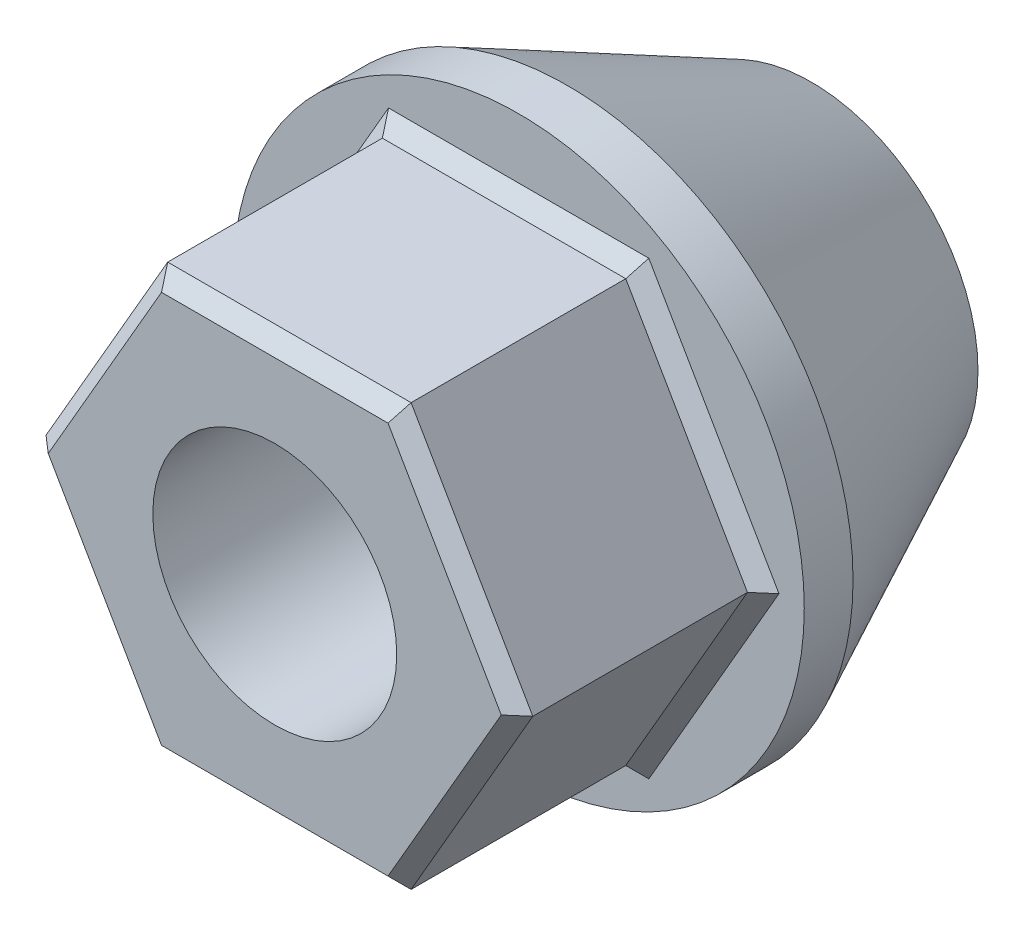
ISO-10303-21;
HEADER;
FILE_DESCRIPTION(('STEP AP214'),'2;1');
FILE_NAME('part.step','',(''),(''),'','','');
FILE_SCHEMA(('AUTOMOTIVE_DESIGN { 1 0 10303 214 1 1 1 1 }'));
ENDSEC;
DATA;
#1=APPLICATION_CONTEXT('core data for automotive mechanical design processes');
#2=APPLICATION_PROTOCOL_DEFINITION('international standard','automotive_design',2000,#1);
#3=PRODUCT_CONTEXT('',#1,'mechanical');
#4=PRODUCT('Part','Part','',(#3));
#5=PRODUCT_RELATED_PRODUCT_CATEGORY('part','',(#4));
#6=PRODUCT_DEFINITION_FORMATION('','',#4);
#7=PRODUCT_DEFINITION_CONTEXT('part definition',#1,'design');
#8=PRODUCT_DEFINITION('design','',#6,#7);
#9=PRODUCT_DEFINITION_SHAPE('','',#8);
#10=(LENGTH_UNIT() NAMED_UNIT(*) SI_UNIT(.MILLI.,.METRE.));
#11=(NAMED_UNIT(*) PLANE_ANGLE_UNIT() SI_UNIT($,.RADIAN.));
#12=(NAMED_UNIT(*) SI_UNIT($,.STERADIAN.) SOLID_ANGLE_UNIT());
#13=UNCERTAINTY_MEASURE_WITH_UNIT(LENGTH_MEASURE(1.E-05),#10,'distance_accuracy_value','');
#14=(GEOMETRIC_REPRESENTATION_CONTEXT(3) GLOBAL_UNCERTAINTY_ASSIGNED_CONTEXT((#13)) GLOBAL_UNIT_ASSIGNED_CONTEXT((#10,
#11,#12)) REPRESENTATION_CONTEXT('',''));
#15=CARTESIAN_POINT('',(0.,0.,0.));
#16=DIRECTION('',(0.,0.,1.));
#17=DIRECTION('',(1.,0.,0.));
#18=AXIS2_PLACEMENT_3D('',#15,#16,#17);
#19=CARTESIAN_POINT('',(6.33668763102738,-10.9754649286324,12.7));
#20=DIRECTION('',(-0.866025403784442,0.499999999999995,0.));
#21=DIRECTION('',(-0.499999999999995,-0.866025403784442,0.));
#22=AXIS2_PLACEMENT_3D('',#19,#20,#21);
#23=PLANE('',#22);
#24=DIRECTION('',(0.,0.,-1.));
#25=VECTOR('',#24,1.);
#26=CARTESIAN_POINT('',(12.6733752620545,0.,12.7));
#27=LINE('',#26,#25);
#28=CARTESIAN_POINT('',(12.6733752620545,0.,11.938));
#29=VERTEX_POINT('',#28);
#30=CARTESIAN_POINT('',(12.6733752620545,0.,0.762000000000009));
#31=VERTEX_POINT('',#30);
#32=EDGE_CURVE('E148',#29,#31,#27,.T.);
#33=ORIENTED_EDGE('',*,*,#32,.F.);
#34=DIRECTION('',(-0.499999999999995,-0.866025403784442,0.));
#35=VECTOR('',#34,1.);
#36=CARTESIAN_POINT('',(6.33668763102738,-10.9754649286324,11.938));
#37=LINE('',#36,#35);
#38=CARTESIAN_POINT('',(6.33668763102738,-10.9754649286324,11.938));
#39=VERTEX_POINT('',#38);
#40=EDGE_CURVE('E11',#29,#39,#37,.T.);
#41=ORIENTED_EDGE('',*,*,#40,.T.);
#42=DIRECTION('',(0.,0.,-1.));
#43=VECTOR('',#42,1.);
#44=CARTESIAN_POINT('',(6.33668763102738,-10.9754649286324,12.7));
#45=LINE('',#44,#43);
#46=CARTESIAN_POINT('',(6.33668763102738,-10.9754649286324,0.762000000000009));
#47=VERTEX_POINT('',#46);
#48=EDGE_CURVE('E238',#39,#47,#45,.T.);
#49=ORIENTED_EDGE('',*,*,#48,.T.);
#50=DIRECTION('',(0.499999999999995,0.866025403784442,0.));
#51=VECTOR('',#50,1.);
#52=CARTESIAN_POINT('',(12.6733752620545,0.,0.76200000000001));
#53=LINE('',#52,#51);
#54=EDGE_CURVE('E168',#47,#31,#53,.T.);
#55=ORIENTED_EDGE('',*,*,#54,.T.);
#56=EDGE_LOOP('',(#33,#41,#49,#55));
#57=FACE_BOUND('',#56,.T.);
#58=ADVANCED_FACE('F26',(#57),#23,.F.);
#59=CARTESIAN_POINT('',(12.6733752620545,0.,12.7));
#60=DIRECTION('',(-0.866025403784438,-0.500000000000001,0.));
#61=DIRECTION('',(0.500000000000001,-0.866025403784438,0.));
#62=AXIS2_PLACEMENT_3D('',#59,#60,#61);
#63=PLANE('',#62);
#64=DIRECTION('',(0.,0.,-1.));
#65=VECTOR('',#64,1.);
#66=CARTESIAN_POINT('',(6.33668763102723,10.9754649286325,12.7));
#67=LINE('',#66,#65);
#68=CARTESIAN_POINT('',(6.33668763102723,10.9754649286325,11.938));
#69=VERTEX_POINT('',#68);
#70=CARTESIAN_POINT('',(6.33668763102723,10.9754649286325,0.762000000000009));
#71=VERTEX_POINT('',#70);
#72=EDGE_CURVE('E122',#69,#71,#67,.T.);
#73=ORIENTED_EDGE('',*,*,#72,.F.);
#74=DIRECTION('',(0.500000000000001,-0.866025403784438,0.));
#75=VECTOR('',#74,1.);
#76=CARTESIAN_POINT('',(12.6733752620545,0.,11.938));
#77=LINE('',#76,#75);
#78=EDGE_CURVE('E33',#69,#29,#77,.T.);
#79=ORIENTED_EDGE('',*,*,#78,.T.);
#80=ORIENTED_EDGE('',*,*,#32,.T.);
#81=DIRECTION('',(-0.500000000000001,0.866025403784438,0.));
#82=VECTOR('',#81,1.);
#83=CARTESIAN_POINT('',(6.33668763102723,10.9754649286325,0.762000000000009));
#84=LINE('',#83,#82);
#85=EDGE_CURVE('E171',#31,#71,#84,.T.);
#86=ORIENTED_EDGE('',*,*,#85,.T.);
#87=EDGE_LOOP('',(#73,#79,#80,#86));
#88=FACE_BOUND('',#87,.T.);
#89=ADVANCED_FACE('F307',(#88),#63,.F.);
#90=CARTESIAN_POINT('',(6.33668763102723,10.9754649286325,12.7));
#91=DIRECTION('',(0.,-1.,0.));
#92=DIRECTION('',(1.,0.,0.));
#93=AXIS2_PLACEMENT_3D('',#90,#91,#92);
#94=PLANE('',#93);
#95=DIRECTION('',(0.,0.,-1.));
#96=VECTOR('',#95,1.);
#97=CARTESIAN_POINT('',(-6.3366876310273,10.9754649286324,12.7));
#98=LINE('',#97,#96);
#99=CARTESIAN_POINT('',(-6.3366876310273,10.9754649286324,11.938));
#100=VERTEX_POINT('',#99);
#101=CARTESIAN_POINT('',(-6.3366876310273,10.9754649286324,0.762000000000009));
#102=VERTEX_POINT('',#101);
#103=EDGE_CURVE('E112',#100,#102,#98,.T.);
#104=ORIENTED_EDGE('',*,*,#103,.F.);
#105=DIRECTION('',(1.,0.,0.));
#106=VECTOR('',#105,1.);
#107=CARTESIAN_POINT('',(6.33668763102723,10.9754649286325,11.938));
#108=LINE('',#107,#106);
#109=EDGE_CURVE('E47',#100,#69,#108,.T.);
#110=ORIENTED_EDGE('',*,*,#109,.T.);
#111=ORIENTED_EDGE('',*,*,#72,.T.);
#112=DIRECTION('',(-1.,0.,0.));
#113=VECTOR('',#112,1.);
#114=CARTESIAN_POINT('',(-6.3366876310273,10.9754649286324,0.762000000000009));
#115=LINE('',#114,#113);
#116=EDGE_CURVE('E131',#71,#102,#115,.T.);
#117=ORIENTED_EDGE('',*,*,#116,.T.);
#118=EDGE_LOOP('',(#104,#110,#111,#117));
#119=FACE_BOUND('',#118,.T.);
#120=ADVANCED_FACE('F145',(#119),#94,.F.);
#121=CARTESIAN_POINT('',(-6.3366876310273,10.9754649286324,12.7));
#122=DIRECTION('',(0.866025403784441,-0.499999999999995,0.));
#123=DIRECTION('',(0.499999999999995,0.866025403784441,0.));
#124=AXIS2_PLACEMENT_3D('',#121,#122,#123);
#125=PLANE('',#124);
#126=DIRECTION('',(0.,0.,-1.));
#127=VECTOR('',#126,1.);
#128=CARTESIAN_POINT('',(-12.6733752620545,0.,12.7));
#129=LINE('',#128,#127);
#130=CARTESIAN_POINT('',(-12.6733752620545,0.,11.938));
#131=VERTEX_POINT('',#130);
#132=CARTESIAN_POINT('',(-12.6733752620545,0.,0.762000000000009));
#133=VERTEX_POINT('',#132);
#134=EDGE_CURVE('E123',#131,#133,#129,.T.);
#135=ORIENTED_EDGE('',*,*,#134,.F.);
#136=DIRECTION('',(0.499999999999995,0.866025403784441,0.));
#137=VECTOR('',#136,1.);
#138=CARTESIAN_POINT('',(-6.3366876310273,10.9754649286324,11.938));
#139=LINE('',#138,#137);
#140=EDGE_CURVE('E120',#131,#100,#139,.T.);
#141=ORIENTED_EDGE('',*,*,#140,.T.);
#142=ORIENTED_EDGE('',*,*,#103,.T.);
#143=DIRECTION('',(-0.499999999999995,-0.866025403784441,0.));
#144=VECTOR('',#143,1.);
#145=CARTESIAN_POINT('',(-12.6733752620545,0.,0.76200000000001));
#146=LINE('',#145,#144);
#147=EDGE_CURVE('E117',#102,#133,#146,.T.);
#148=ORIENTED_EDGE('',*,*,#147,.T.);
#149=EDGE_LOOP('',(#135,#141,#142,#148));
#150=FACE_BOUND('',#149,.T.);
#151=ADVANCED_FACE('F115',(#150),#125,.F.);
#152=CARTESIAN_POINT('',(-12.6733752620545,0.,12.7));
#153=DIRECTION('',(0.866025403784434,0.500000000000007,0.));
#154=DIRECTION('',(-0.500000000000007,0.866025403784435,0.));
#155=AXIS2_PLACEMENT_3D('',#152,#153,#154);
#156=PLANE('',#155);
#157=DIRECTION('',(0.,0.,-1.));
#158=VECTOR('',#157,1.);
#159=CARTESIAN_POINT('',(-6.33668763102715,-10.9754649286325,12.7));
#160=LINE('',#159,#158);
#161=CARTESIAN_POINT('',(-6.33668763102715,-10.9754649286325,11.938));
#162=VERTEX_POINT('',#161);
#163=CARTESIAN_POINT('',(-6.33668763102715,-10.9754649286325,0.762000000000009));
#164=VERTEX_POINT('',#163);
#165=EDGE_CURVE('E196',#162,#164,#160,.T.);
#166=ORIENTED_EDGE('',*,*,#165,.F.);
#167=DIRECTION('',(-0.500000000000007,0.866025403784435,0.));
#168=VECTOR('',#167,1.);
#169=CARTESIAN_POINT('',(-12.6733752620545,0.,11.938));
#170=LINE('',#169,#168);
#171=EDGE_CURVE('E189',#162,#131,#170,.T.);
#172=ORIENTED_EDGE('',*,*,#171,.T.);
#173=ORIENTED_EDGE('',*,*,#134,.T.);
#174=DIRECTION('',(0.500000000000007,-0.866025403784435,0.));
#175=VECTOR('',#174,1.);
#176=CARTESIAN_POINT('',(-6.33668763102715,-10.9754649286325,0.76200000000001));
#177=LINE('',#176,#175);
#178=EDGE_CURVE('E143',#133,#164,#177,.T.);
#179=ORIENTED_EDGE('',*,*,#178,.T.);
#180=EDGE_LOOP('',(#166,#172,#173,#179));
#181=FACE_BOUND('',#180,.T.);
#182=ADVANCED_FACE('F195',(#181),#156,.F.);
#183=CARTESIAN_POINT('',(-6.33668763102715,-10.9754649286325,12.7));
#184=DIRECTION('',(0.,1.,0.));
#185=DIRECTION('',(-1.,0.,0.));
#186=AXIS2_PLACEMENT_3D('',#183,#184,#185);
#187=PLANE('',#186);
#188=ORIENTED_EDGE('',*,*,#48,.F.);
#189=DIRECTION('',(-1.,0.,0.));
#190=VECTOR('',#189,1.);
#191=CARTESIAN_POINT('',(-6.33668763102715,-10.9754649286325,11.938));
#192=LINE('',#191,#190);
#193=EDGE_CURVE('E186',#39,#162,#192,.T.);
#194=ORIENTED_EDGE('',*,*,#193,.T.);
#195=ORIENTED_EDGE('',*,*,#165,.T.);
#196=DIRECTION('',(1.,0.,0.));
#197=VECTOR('',#196,1.);
#198=CARTESIAN_POINT('',(6.33668763102738,-10.9754649286324,0.762000000000009));
#199=LINE('',#198,#197);
#200=EDGE_CURVE('E165',#164,#47,#199,.T.);
#201=ORIENTED_EDGE('',*,*,#200,.T.);
#202=EDGE_LOOP('',(#188,#194,#195,#201));
#203=FACE_BOUND('',#202,.T.);
#204=ADVANCED_FACE('F242',(#203),#187,.F.);
#205=CARTESIAN_POINT('',(19.0100628930817,10.9754649286325,12.7));
#206=DIRECTION('',(0.,0.,1.));
#207=DIRECTION('',(1.,0.,0.));
#208=AXIS2_PLACEMENT_3D('',#205,#206,#207);
#209=PLANE('',#208);
#210=CARTESIAN_POINT('',(0.,0.,12.7));
#211=DIRECTION('',(0.,0.,1.));
#212=DIRECTION('',(1.,0.,0.));
#213=AXIS2_PLACEMENT_3D('',#210,#211,#212);
#214=CIRCLE('',#213,6.35);
#215=CARTESIAN_POINT('',(6.35,0.,12.7));
#216=VERTEX_POINT('',#215);
#217=EDGE_CURVE('E281',#216,#216,#214,.T.);
#218=ORIENTED_EDGE('',*,*,#217,.F.);
#219=EDGE_LOOP('',(#218));
#220=FACE_BOUND('',#219,.T.);
#221=DIRECTION('',(0.500000000000007,-0.866025403784435,0.));
#222=VECTOR('',#221,1.);
#223=CARTESIAN_POINT('',(-5.67677627334341,-10.5944649286325,12.7));
#224=LINE('',#223,#222);
#225=CARTESIAN_POINT('',(-11.7934934518095,0.,12.7));
#226=VERTEX_POINT('',#225);
#227=CARTESIAN_POINT('',(-5.89674672590466,-10.2134649286325,12.7));
#228=VERTEX_POINT('',#227);
#229=EDGE_CURVE('E181',#226,#228,#224,.T.);
#230=ORIENTED_EDGE('',*,*,#229,.T.);
#231=DIRECTION('',(1.,0.,0.));
#232=VECTOR('',#231,1.);
#233=CARTESIAN_POINT('',(6.33668763102737,-10.2134649286324,12.7));
#234=LINE('',#233,#232);
#235=CARTESIAN_POINT('',(5.89674672590488,-10.2134649286324,12.7));
#236=VERTEX_POINT('',#235);
#237=EDGE_CURVE('E183',#228,#236,#234,.T.);
#238=ORIENTED_EDGE('',*,*,#237,.T.);
#239=DIRECTION('',(0.499999999999995,0.866025403784442,0.));
#240=VECTOR('',#239,1.);
#241=CARTESIAN_POINT('',(12.0134639043708,0.380999999999998,12.7));
#242=LINE('',#241,#240);
#243=CARTESIAN_POINT('',(11.7934934518095,0.,12.7));
#244=VERTEX_POINT('',#243);
#245=EDGE_CURVE('E173',#236,#244,#242,.T.);
#246=ORIENTED_EDGE('',*,*,#245,.T.);
#247=DIRECTION('',(-0.500000000000001,0.866025403784438,0.));
#248=VECTOR('',#247,1.);
#249=CARTESIAN_POINT('',(5.67677627334348,10.5944649286325,12.7));
#250=LINE('',#249,#248);
#251=CARTESIAN_POINT('',(5.89674672590473,10.2134649286325,12.7));
#252=VERTEX_POINT('',#251);
#253=EDGE_CURVE('E175',#244,#252,#250,.T.);
#254=ORIENTED_EDGE('',*,*,#253,.T.);
#255=DIRECTION('',(-1.,0.,0.));
#256=VECTOR('',#255,1.);
#257=CARTESIAN_POINT('',(-6.3366876310273,10.2134649286324,12.7));
#258=LINE('',#257,#256);
#259=CARTESIAN_POINT('',(-5.8967467259048,10.2134649286324,12.7));
#260=VERTEX_POINT('',#259);
#261=EDGE_CURVE('E177',#252,#260,#258,.T.);
#262=ORIENTED_EDGE('',*,*,#261,.T.);
#263=DIRECTION('',(-0.499999999999995,-0.866025403784441,0.));
#264=VECTOR('',#263,1.);
#265=CARTESIAN_POINT('',(-12.0134639043708,-0.381000000000087,12.7));
#266=LINE('',#265,#264);
#267=EDGE_CURVE('E179',#260,#226,#266,.T.);
#268=ORIENTED_EDGE('',*,*,#267,.T.);
#269=EDGE_LOOP('',(#230,#238,#246,#254,#262,#268));
#270=FACE_BOUND('',#269,.T.);
#271=ADVANCED_FACE('F287',(#220,#270),#209,.T.);
#272=CARTESIAN_POINT('',(0.,0.,0.));
#273=DIRECTION('',(0.,0.,-1.));
#274=DIRECTION('',(-1.,0.,0.));
#275=AXIS2_PLACEMENT_3D('',#272,#273,#274);
#276=PLANE('',#275);
#277=DIRECTION('',(0.499999999999995,0.866025403784441,0.));
#278=VECTOR('',#277,1.);
#279=CARTESIAN_POINT('',(-6.99659898871105,11.3564649286324,0.));
#280=LINE('',#279,#278);
#281=CARTESIAN_POINT('',(-13.5532570722995,0.,0.));
#282=VERTEX_POINT('',#281);
#283=CARTESIAN_POINT('',(-6.7766285361498,11.7374649286324,0.));
#284=VERTEX_POINT('',#283);
#285=EDGE_CURVE('E160',#282,#284,#280,.T.);
#286=ORIENTED_EDGE('',*,*,#285,.T.);
#287=DIRECTION('',(1.,0.,0.));
#288=VECTOR('',#287,1.);
#289=CARTESIAN_POINT('',(6.33668763102722,11.7374649286325,0.));
#290=LINE('',#289,#288);
#291=CARTESIAN_POINT('',(6.77662853614972,11.7374649286325,0.));
#292=VERTEX_POINT('',#291);
#293=EDGE_CURVE('E133',#284,#292,#290,.T.);
#294=ORIENTED_EDGE('',*,*,#293,.T.);
#295=DIRECTION('',(0.500000000000001,-0.866025403784438,0.));
#296=VECTOR('',#295,1.);
#297=CARTESIAN_POINT('',(13.3332866197382,0.381000000000002,0.));
#298=LINE('',#297,#296);
#299=CARTESIAN_POINT('',(13.5532570722995,0.,0.));
#300=VERTEX_POINT('',#299);
#301=EDGE_CURVE('E147',#292,#300,#298,.T.);
#302=ORIENTED_EDGE('',*,*,#301,.T.);
#303=DIRECTION('',(-0.499999999999995,-0.866025403784442,0.));
#304=VECTOR('',#303,1.);
#305=CARTESIAN_POINT('',(6.99659898871112,-11.3564649286324,0.));
#306=LINE('',#305,#304);
#307=CARTESIAN_POINT('',(6.77662853614988,-11.7374649286324,0.));
#308=VERTEX_POINT('',#307);
#309=EDGE_CURVE('E150',#300,#308,#306,.T.);
#310=ORIENTED_EDGE('',*,*,#309,.T.);
#311=DIRECTION('',(-1.,0.,0.));
#312=VECTOR('',#311,1.);
#313=CARTESIAN_POINT('',(-6.33668763102714,-11.7374649286325,0.));
#314=LINE('',#313,#312);
#315=CARTESIAN_POINT('',(-6.77662853614964,-11.7374649286325,0.));
#316=VERTEX_POINT('',#315);
#317=EDGE_CURVE('E156',#308,#316,#314,.T.);
#318=ORIENTED_EDGE('',*,*,#317,.T.);
#319=DIRECTION('',(-0.500000000000007,0.866025403784435,0.));
#320=VECTOR('',#319,1.);
#321=CARTESIAN_POINT('',(-13.3332866197382,-0.381000000000094,0.));
#322=LINE('',#321,#320);
#323=EDGE_CURVE('E158',#316,#282,#322,.T.);
#324=ORIENTED_EDGE('',*,*,#323,.T.);
#325=EDGE_LOOP('',(#286,#294,#302,#310,#318,#324));
#326=FACE_BOUND('',#325,.T.);
#327=CARTESIAN_POINT('',(0.,0.,0.));
#328=DIRECTION('',(0.,0.,-1.));
#329=DIRECTION('',(-1.,0.,0.));
#330=AXIS2_PLACEMENT_3D('',#327,#328,#329);
#331=CIRCLE('',#330,14.8695028092296);
#332=CARTESIAN_POINT('',(-14.8695028092296,0.,0.));
#333=VERTEX_POINT('',#332);
#334=EDGE_CURVE('E232',#333,#333,#331,.T.);
#335=ORIENTED_EDGE('',*,*,#334,.F.);
#336=EDGE_LOOP('',(#335));
#337=FACE_BOUND('',#336,.T.);
#338=ADVANCED_FACE('F255',(#326,#337),#276,.F.);
#339=CARTESIAN_POINT('',(0.,0.,-2.54));
#340=DIRECTION('',(0.,0.,1.));
#341=DIRECTION('',(1.,0.,0.));
#342=AXIS2_PLACEMENT_3D('',#339,#340,#341);
#343=CYLINDRICAL_SURFACE('',#342,14.8695028092296);
#344=CARTESIAN_POINT('',(0.,0.,-2.54));
#345=DIRECTION('',(0.,0.,-1.));
#346=DIRECTION('',(-1.,0.,0.));
#347=AXIS2_PLACEMENT_3D('',#344,#345,#346);
#348=CIRCLE('',#347,14.8695028092296);
#349=CARTESIAN_POINT('',(-14.8695028092296,0.,-2.54));
#350=VERTEX_POINT('',#349);
#351=EDGE_CURVE('E235',#350,#350,#348,.T.);
#352=ORIENTED_EDGE('',*,*,#351,.F.);
#353=EDGE_LOOP('',(#352));
#354=FACE_BOUND('',#353,.T.);
#355=ORIENTED_EDGE('',*,*,#334,.T.);
#356=EDGE_LOOP('',(#355));
#357=FACE_BOUND('',#356,.T.);
#358=ADVANCED_FACE('F323',(#354,#357),#343,.T.);
#359=CARTESIAN_POINT('',(-6.33668763102715,-10.9754649286325,0.762000000000009));
#360=DIRECTION('',(0.,-0.707106781186551,0.707106781186544));
#361=DIRECTION('',(0.,-0.707106781186544,-0.707106781186551));
#362=AXIS2_PLACEMENT_3D('',#359,#360,#361);
#363=PLANE('',#362);
#364=DIRECTION('',(-0.377964473009219,-0.654653670707979,-0.654653670707981));
#365=VECTOR('',#364,1.);
#366=CARTESIAN_POINT('',(-6.33668763102715,-10.9754649286325,0.76200000000001));
#367=LINE('',#366,#365);
#368=EDGE_CURVE('E226',#316,#164,#367,.F.);
#369=ORIENTED_EDGE('',*,*,#368,.F.);
#370=ORIENTED_EDGE('',*,*,#317,.F.);
#371=DIRECTION('',(0.377964473009229,-0.654653670707972,-0.654653670707982));
#372=VECTOR('',#371,1.);
#373=CARTESIAN_POINT('',(6.33668763102738,-10.9754649286324,0.762000000000009));
#374=LINE('',#373,#372);
#375=EDGE_CURVE('E229',#47,#308,#374,.T.);
#376=ORIENTED_EDGE('',*,*,#375,.F.);
#377=ORIENTED_EDGE('',*,*,#200,.F.);
#378=EDGE_LOOP('',(#369,#370,#376,#377));
#379=FACE_BOUND('',#378,.T.);
#380=ADVANCED_FACE('F249',(#379),#363,.T.);
#381=CARTESIAN_POINT('',(6.33668763102738,-10.9754649286324,0.762000000000009));
#382=DIRECTION('',(0.6123724356958,-0.353553390593272,0.707106781186543));
#383=DIRECTION('',(0.755928946018449,0.,-0.654653670707983));
#384=AXIS2_PLACEMENT_3D('',#381,#382,#383);
#385=PLANE('',#384);
#386=ORIENTED_EDGE('',*,*,#375,.T.);
#387=ORIENTED_EDGE('',*,*,#309,.F.);
#388=DIRECTION('',(0.755928946018451,0.,-0.654653670707982));
#389=VECTOR('',#388,1.);
#390=CARTESIAN_POINT('',(12.6733752620545,0.,0.762000000000009));
#391=LINE('',#390,#389);
#392=EDGE_CURVE('E223',#31,#300,#391,.T.);
#393=ORIENTED_EDGE('',*,*,#392,.F.);
#394=ORIENTED_EDGE('',*,*,#54,.F.);
#395=EDGE_LOOP('',(#386,#387,#393,#394));
#396=FACE_BOUND('',#395,.T.);
#397=ADVANCED_FACE('F259',(#396),#385,.T.);
#398=CARTESIAN_POINT('',(-12.6733752620545,0.,0.762000000000009));
#399=DIRECTION('',(-0.612372435695795,-0.353553390593281,0.707106781186544));
#400=DIRECTION('',(0.755928946018452,0.,0.654653670707979));
#401=AXIS2_PLACEMENT_3D('',#398,#399,#400);
#402=PLANE('',#401);
#403=ORIENTED_EDGE('',*,*,#368,.T.);
#404=ORIENTED_EDGE('',*,*,#178,.F.);
#405=DIRECTION('',(-0.755928946018451,0.,-0.654653670707981));
#406=VECTOR('',#405,1.);
#407=CARTESIAN_POINT('',(-12.6733752620545,0.,0.76200000000001));
#408=LINE('',#407,#406);
#409=EDGE_CURVE('E142',#282,#133,#408,.F.);
#410=ORIENTED_EDGE('',*,*,#409,.F.);
#411=ORIENTED_EDGE('',*,*,#323,.F.);
#412=EDGE_LOOP('',(#403,#404,#410,#411));
#413=FACE_BOUND('',#412,.T.);
#414=ADVANCED_FACE('F253',(#413),#402,.T.);
#415=CARTESIAN_POINT('',(12.6733752620545,0.,0.762000000000009));
#416=DIRECTION('',(0.612372435695797,0.353553390593276,0.707106781186544));
#417=DIRECTION('',(0.755928946018452,0.,-0.65465367070798));
#418=AXIS2_PLACEMENT_3D('',#415,#416,#417);
#419=PLANE('',#418);
#420=ORIENTED_EDGE('',*,*,#392,.T.);
#421=ORIENTED_EDGE('',*,*,#301,.F.);
#422=DIRECTION('',(-0.377964473009224,-0.654653670707976,0.65465367070798));
#423=VECTOR('',#422,1.);
#424=CARTESIAN_POINT('',(4.52620545073374,7.83961780616607,3.89784712246645));
#425=LINE('',#424,#423);
#426=EDGE_CURVE('E136',#71,#292,#425,.F.);
#427=ORIENTED_EDGE('',*,*,#426,.F.);
#428=ORIENTED_EDGE('',*,*,#85,.F.);
#429=EDGE_LOOP('',(#420,#421,#427,#428));
#430=FACE_BOUND('',#429,.T.);
#431=ADVANCED_FACE('F335',(#430),#419,.T.);
#432=CARTESIAN_POINT('',(-6.3366876310273,10.9754649286324,0.762000000000009));
#433=DIRECTION('',(-0.612372435695799,0.353553390593272,0.707106781186544));
#434=DIRECTION('',(0.75592894601845,0.,0.654653670707982));
#435=AXIS2_PLACEMENT_3D('',#432,#433,#434);
#436=PLANE('',#435);
#437=ORIENTED_EDGE('',*,*,#409,.T.);
#438=ORIENTED_EDGE('',*,*,#147,.F.);
#439=DIRECTION('',(-0.377964473009229,0.654653670707973,-0.65465367070798));
#440=VECTOR('',#439,1.);
#441=CARTESIAN_POINT('',(-6.3366876310273,10.9754649286324,0.762000000000009));
#442=LINE('',#441,#440);
#443=EDGE_CURVE('E129',#284,#102,#442,.F.);
#444=ORIENTED_EDGE('',*,*,#443,.F.);
#445=ORIENTED_EDGE('',*,*,#285,.F.);
#446=EDGE_LOOP('',(#437,#438,#444,#445));
#447=FACE_BOUND('',#446,.T.);
#448=ADVANCED_FACE('F140',(#447),#436,.T.);
#449=CARTESIAN_POINT('',(6.33668763102723,10.9754649286325,0.762000000000009));
#450=DIRECTION('',(0.,0.707106781186551,0.707106781186544));
#451=DIRECTION('',(0.,-0.707106781186544,0.707106781186551));
#452=AXIS2_PLACEMENT_3D('',#449,#450,#451);
#453=PLANE('',#452);
#454=ORIENTED_EDGE('',*,*,#426,.T.);
#455=ORIENTED_EDGE('',*,*,#293,.F.);
#456=ORIENTED_EDGE('',*,*,#443,.T.);
#457=ORIENTED_EDGE('',*,*,#116,.F.);
#458=EDGE_LOOP('',(#454,#455,#456,#457));
#459=FACE_BOUND('',#458,.T.);
#460=ADVANCED_FACE('F130',(#459),#453,.T.);
#461=CARTESIAN_POINT('',(19.0100628930817,10.2134649286325,12.7));
#462=DIRECTION('',(0.,0.707106781186548,0.707106781186547));
#463=DIRECTION('',(0.,-0.707106781186547,0.707106781186548));
#464=AXIS2_PLACEMENT_3D('',#461,#462,#463);
#465=PLANE('',#464);
#466=DIRECTION('',(-0.377964473009224,-0.654653670707978,0.654653670707978));
#467=VECTOR('',#466,1.);
#468=CARTESIAN_POINT('',(5.05435433648978,8.75439851025641,14.1590664183761));
#469=LINE('',#468,#467);
#470=EDGE_CURVE('E210',#69,#252,#469,.T.);
#471=ORIENTED_EDGE('',*,*,#470,.F.);
#472=ORIENTED_EDGE('',*,*,#109,.F.);
#473=DIRECTION('',(0.377964473009231,-0.654653670707975,0.654653670707978));
#474=VECTOR('',#473,1.);
#475=CARTESIAN_POINT('',(-2.33863106604954,4.05062782655675,18.8628371020757));
#476=LINE('',#475,#474);
#477=EDGE_CURVE('E137',#260,#100,#476,.F.);
#478=ORIENTED_EDGE('',*,*,#477,.F.);
#479=ORIENTED_EDGE('',*,*,#261,.F.);
#480=EDGE_LOOP('',(#471,#472,#478,#479));
#481=FACE_BOUND('',#480,.T.);
#482=ADVANCED_FACE('F295',(#481),#465,.T.);
#483=CARTESIAN_POINT('',(0.659911357683611,21.5699298572649,12.7));
#484=DIRECTION('',(-0.612372435695797,0.353553390593271,0.707106781186547));
#485=DIRECTION('',(0.755928946018453,0.,0.654653670707979));
#486=AXIS2_PLACEMENT_3D('',#483,#484,#485);
#487=PLANE('',#486);
#488=ORIENTED_EDGE('',*,*,#477,.T.);
#489=ORIENTED_EDGE('',*,*,#140,.F.);
#490=DIRECTION('',(0.755928946018453,0.,0.654653670707979));
#491=VECTOR('',#490,1.);
#492=CARTESIAN_POINT('',(-4.67726213209916,0.,18.8628371020757));
#493=LINE('',#492,#491);
#494=EDGE_CURVE('E206',#226,#131,#493,.F.);
#495=ORIENTED_EDGE('',*,*,#494,.F.);
#496=ORIENTED_EDGE('',*,*,#267,.F.);
#497=EDGE_LOOP('',(#488,#489,#495,#496));
#498=FACE_BOUND('',#497,.T.);
#499=ADVANCED_FACE('F204',(#498),#487,.T.);
#500=CARTESIAN_POINT('',(8.8451200888571,5.10673246431628,12.7));
#501=DIRECTION('',(0.612372435695795,0.353553390593275,0.707106781186546));
#502=DIRECTION('',(0.755928946018453,0.,-0.654653670707978));
#503=AXIS2_PLACEMENT_3D('',#500,#501,#502);
#504=PLANE('',#503);
#505=ORIENTED_EDGE('',*,*,#470,.T.);
#506=ORIENTED_EDGE('',*,*,#253,.F.);
#507=DIRECTION('',(-0.755928946018453,0.,0.654653670707979));
#508=VECTOR('',#507,1.);
#509=CARTESIAN_POINT('',(15.5401552138601,0.,9.45529573467644));
#510=LINE('',#509,#508);
#511=EDGE_CURVE('E211',#29,#244,#510,.T.);
#512=ORIENTED_EDGE('',*,*,#511,.F.);
#513=ORIENTED_EDGE('',*,*,#78,.F.);
#514=EDGE_LOOP('',(#505,#506,#512,#513));
#515=FACE_BOUND('',#514,.T.);
#516=ADVANCED_FACE('F297',(#515),#504,.T.);
#517=CARTESIAN_POINT('',(-8.84512008885704,-5.10673246431639,12.7));
#518=DIRECTION('',(-0.612372435695794,-0.35355339059328,0.707106781186545));
#519=DIRECTION('',(0.755928946018454,0.,0.654653670707978));
#520=AXIS2_PLACEMENT_3D('',#517,#518,#519);
#521=PLANE('',#520);
#522=ORIENTED_EDGE('',*,*,#494,.T.);
#523=ORIENTED_EDGE('',*,*,#171,.F.);
#524=DIRECTION('',(0.377964473009218,0.654653670707981,0.654653670707979));
#525=VECTOR('',#524,1.);
#526=CARTESIAN_POINT('',(-5.05435433648973,-8.75439851025645,14.1590664183761));
#527=LINE('',#526,#525);
#528=EDGE_CURVE('E216',#228,#162,#527,.F.);
#529=ORIENTED_EDGE('',*,*,#528,.F.);
#530=ORIENTED_EDGE('',*,*,#229,.F.);
#531=EDGE_LOOP('',(#522,#523,#529,#530));
#532=FACE_BOUND('',#531,.T.);
#533=ADVANCED_FACE('F209',(#532),#521,.T.);
#534=CARTESIAN_POINT('',(18.350151535398,11.3564649286325,12.7));
#535=DIRECTION('',(0.612372435695798,-0.353553390593271,0.707106781186546));
#536=DIRECTION('',(0.755928946018452,0.,-0.65465367070798));
#537=AXIS2_PLACEMENT_3D('',#534,#535,#536);
#538=PLANE('',#537);
#539=ORIENTED_EDGE('',*,*,#511,.T.);
#540=ORIENTED_EDGE('',*,*,#245,.F.);
#541=DIRECTION('',(0.377964473009231,-0.654653670707974,-0.654653670707979));
#542=VECTOR('',#541,1.);
#543=CARTESIAN_POINT('',(2.33863106604966,-4.05062782655677,18.8628371020757));
#544=LINE('',#543,#542);
#545=EDGE_CURVE('E269',#39,#236,#544,.F.);
#546=ORIENTED_EDGE('',*,*,#545,.F.);
#547=ORIENTED_EDGE('',*,*,#40,.F.);
#548=EDGE_LOOP('',(#539,#540,#546,#547));
#549=FACE_BOUND('',#548,.T.);
#550=ADVANCED_FACE('F272',(#549),#538,.T.);
#551=CARTESIAN_POINT('',(19.0100628930819,-10.2134649286323,12.7));
#552=DIRECTION('',(0.,-0.707106781186548,0.707106781186547));
#553=DIRECTION('',(0.,-0.707106781186547,-0.707106781186548));
#554=AXIS2_PLACEMENT_3D('',#551,#552,#553);
#555=PLANE('',#554);
#556=ORIENTED_EDGE('',*,*,#528,.T.);
#557=ORIENTED_EDGE('',*,*,#193,.F.);
#558=ORIENTED_EDGE('',*,*,#545,.T.);
#559=ORIENTED_EDGE('',*,*,#237,.F.);
#560=EDGE_LOOP('',(#556,#557,#558,#559));
#561=FACE_BOUND('',#560,.T.);
#562=ADVANCED_FACE('F267',(#561),#555,.T.);
#563=CARTESIAN_POINT('',(0.,0.,-2.54));
#564=DIRECTION('',(0.,0.,1.));
#565=DIRECTION('',(-1.,0.,0.));
#566=AXIS2_PLACEMENT_3D('',#563,#564,#565);
#567=CONICAL_SURFACE('',#566,14.8695028092296,0.453785605518526);
#568=CARTESIAN_POINT('',(0.,0.,-15.24));
#569=DIRECTION('',(0.,0.,-1.));
#570=DIRECTION('',(-1.,0.,0.));
#571=AXIS2_PLACEMENT_3D('',#568,#569,#570);
#572=CIRCLE('',#571,8.67529893444314);
#573=CARTESIAN_POINT('',(-8.67529893444314,0.,-15.24));
#574=VERTEX_POINT('',#573);
#575=EDGE_CURVE('E273',#574,#574,#572,.T.);
#576=ORIENTED_EDGE('',*,*,#575,.F.);
#577=EDGE_LOOP('',(#576));
#578=FACE_BOUND('',#577,.T.);
#579=ORIENTED_EDGE('',*,*,#351,.T.);
#580=EDGE_LOOP('',(#579));
#581=FACE_BOUND('',#580,.T.);
#582=ADVANCED_FACE('F371',(#578,#581),#567,.T.);
#583=CARTESIAN_POINT('',(0.,0.,-15.24));
#584=DIRECTION('',(0.,0.,-1.));
#585=DIRECTION('',(-1.,0.,0.));
#586=AXIS2_PLACEMENT_3D('',#583,#584,#585);
#587=PLANE('',#586);
#588=CARTESIAN_POINT('',(0.,0.,-15.24));
#589=DIRECTION('',(0.,0.,1.));
#590=DIRECTION('',(1.,0.,0.));
#591=AXIS2_PLACEMENT_3D('',#588,#589,#590);
#592=CIRCLE('',#591,6.35);
#593=CARTESIAN_POINT('',(6.35,0.,-15.24));
#594=VERTEX_POINT('',#593);
#595=EDGE_CURVE('E276',#594,#594,#592,.T.);
#596=ORIENTED_EDGE('',*,*,#595,.T.);
#597=EDGE_LOOP('',(#596));
#598=FACE_BOUND('',#597,.T.);
#599=ORIENTED_EDGE('',*,*,#575,.T.);
#600=EDGE_LOOP('',(#599));
#601=FACE_BOUND('',#600,.T.);
#602=ADVANCED_FACE('F378',(#598,#601),#587,.T.);
#603=CARTESIAN_POINT('',(0.,0.,-15.24));
#604=DIRECTION('',(0.,0.,1.));
#605=DIRECTION('',(1.,0.,0.));
#606=AXIS2_PLACEMENT_3D('',#603,#604,#605);
#607=CYLINDRICAL_SURFACE('',#606,6.35);
#608=ORIENTED_EDGE('',*,*,#595,.F.);
#609=EDGE_LOOP('',(#608));
#610=FACE_BOUND('',#609,.T.);
#611=ORIENTED_EDGE('',*,*,#217,.T.);
#612=EDGE_LOOP('',(#611));
#613=FACE_BOUND('',#612,.T.);
#614=ADVANCED_FACE('F285',(#610,#613),#607,.F.);
#615=CLOSED_SHELL('',(#58,#89,#120,#151,#182,#204,#271,#338,#358,#380,#397,#414,#431,#448,#460,
#482,#499,#516,#533,#550,#562,#582,#602,#614));
#616=MANIFOLD_SOLID_BREP('B2',#615);
#617=ADVANCED_BREP_SHAPE_REPRESENTATION('',(#18,#616),#14);
#618=SHAPE_DEFINITION_REPRESENTATION(#9,#617);
ENDSEC;
END-ISO-10303-21;
